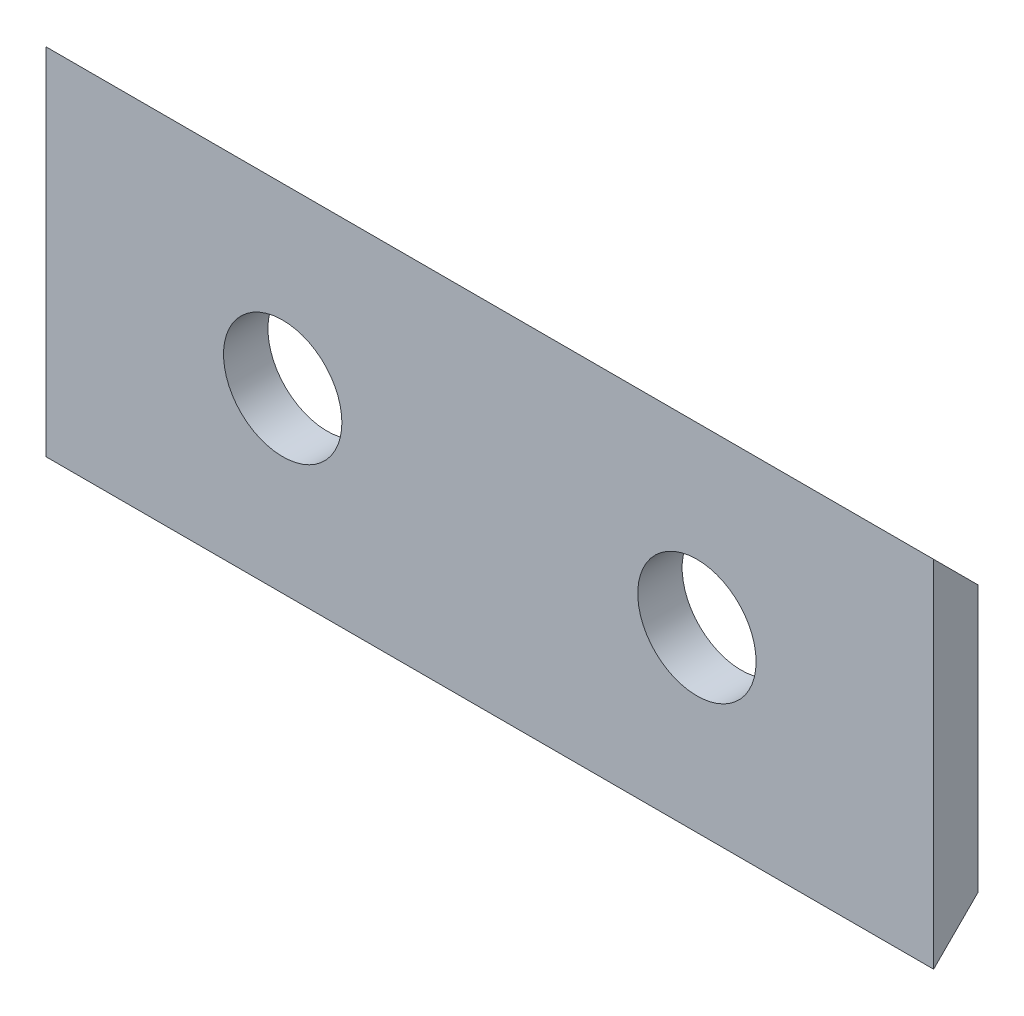
ISO-10303-21;
HEADER;
FILE_DESCRIPTION(('STEP AP214'),'2;1');
FILE_NAME('part.step','',(''),(''),'','','');
FILE_SCHEMA(('AUTOMOTIVE_DESIGN { 1 0 10303 214 1 1 1 1 }'));
ENDSEC;
DATA;
#1=APPLICATION_CONTEXT('core data for automotive mechanical design processes');
#2=APPLICATION_PROTOCOL_DEFINITION('international standard','automotive_design',2000,#1);
#3=PRODUCT_CONTEXT('',#1,'mechanical');
#4=PRODUCT('Part','Part','',(#3));
#5=PRODUCT_RELATED_PRODUCT_CATEGORY('part','',(#4));
#6=PRODUCT_DEFINITION_FORMATION('','',#4);
#7=PRODUCT_DEFINITION_CONTEXT('part definition',#1,'design');
#8=PRODUCT_DEFINITION('design','',#6,#7);
#9=PRODUCT_DEFINITION_SHAPE('','',#8);
#10=(LENGTH_UNIT() NAMED_UNIT(*) SI_UNIT(.MILLI.,.METRE.));
#11=(NAMED_UNIT(*) PLANE_ANGLE_UNIT() SI_UNIT($,.RADIAN.));
#12=(NAMED_UNIT(*) SI_UNIT($,.STERADIAN.) SOLID_ANGLE_UNIT());
#13=UNCERTAINTY_MEASURE_WITH_UNIT(LENGTH_MEASURE(1.E-05),#10,'distance_accuracy_value','');
#14=(GEOMETRIC_REPRESENTATION_CONTEXT(3) GLOBAL_UNCERTAINTY_ASSIGNED_CONTEXT((#13)) GLOBAL_UNIT_ASSIGNED_CONTEXT((#10,
#11,#12)) REPRESENTATION_CONTEXT('',''));
#15=CARTESIAN_POINT('',(0.,0.,0.));
#16=DIRECTION('',(0.,0.,1.));
#17=DIRECTION('',(1.,0.,0.));
#18=AXIS2_PLACEMENT_3D('',#15,#16,#17);
#19=CARTESIAN_POINT('',(0.,0.,1.5));
#20=DIRECTION('',(0.,0.,1.));
#21=DIRECTION('',(1.,0.,0.));
#22=AXIS2_PLACEMENT_3D('',#19,#20,#21);
#23=PLANE('',#22);
#24=CARTESIAN_POINT('',(-22.,6.,1.5));
#25=DIRECTION('',(0.,0.,1.));
#26=DIRECTION('',(1.,0.,0.));
#27=AXIS2_PLACEMENT_3D('',#24,#25,#26);
#28=CIRCLE('',#27,2.);
#29=CARTESIAN_POINT('',(-20.,6.,1.5));
#30=VERTEX_POINT('',#29);
#31=EDGE_CURVE('E96',#30,#30,#28,.T.);
#32=ORIENTED_EDGE('',*,*,#31,.F.);
#33=EDGE_LOOP('',(#32));
#34=FACE_BOUND('',#33,.T.);
#35=DIRECTION('',(0.,1.,0.));
#36=VECTOR('',#35,1.);
#37=CARTESIAN_POINT('',(0.,0.,1.5));
#38=LINE('',#37,#36);
#39=CARTESIAN_POINT('',(0.,0.,1.5));
#40=VERTEX_POINT('',#39);
#41=CARTESIAN_POINT('',(0.,12.,1.5));
#42=VERTEX_POINT('',#41);
#43=EDGE_CURVE('E92',#40,#42,#38,.T.);
#44=ORIENTED_EDGE('',*,*,#43,.T.);
#45=DIRECTION('',(-1.,0.,0.));
#46=VECTOR('',#45,1.);
#47=CARTESIAN_POINT('',(0.,12.,1.5));
#48=LINE('',#47,#46);
#49=CARTESIAN_POINT('',(-30.,12.,1.5));
#50=VERTEX_POINT('',#49);
#51=EDGE_CURVE('E94',#42,#50,#48,.T.);
#52=ORIENTED_EDGE('',*,*,#51,.T.);
#53=DIRECTION('',(0.,-1.,0.));
#54=VECTOR('',#53,1.);
#55=CARTESIAN_POINT('',(-30.,0.,1.5));
#56=LINE('',#55,#54);
#57=CARTESIAN_POINT('',(-30.,0.,1.5));
#58=VERTEX_POINT('',#57);
#59=EDGE_CURVE('E41',#50,#58,#56,.T.);
#60=ORIENTED_EDGE('',*,*,#59,.T.);
#61=DIRECTION('',(1.,0.,0.));
#62=VECTOR('',#61,1.);
#63=CARTESIAN_POINT('',(0.,0.,1.5));
#64=LINE('',#63,#62);
#65=EDGE_CURVE('E11',#58,#40,#64,.T.);
#66=ORIENTED_EDGE('',*,*,#65,.T.);
#67=EDGE_LOOP('',(#44,#52,#60,#66));
#68=FACE_BOUND('',#67,.T.);
#69=CARTESIAN_POINT('',(-8.,6.,1.5));
#70=DIRECTION('',(0.,0.,1.));
#71=DIRECTION('',(1.,0.,0.));
#72=AXIS2_PLACEMENT_3D('',#69,#70,#71);
#73=CIRCLE('',#72,2.);
#74=CARTESIAN_POINT('',(-6.,6.,1.5));
#75=VERTEX_POINT('',#74);
#76=EDGE_CURVE('E107',#75,#75,#73,.T.);
#77=ORIENTED_EDGE('',*,*,#76,.F.);
#78=EDGE_LOOP('',(#77));
#79=FACE_BOUND('',#78,.T.);
#80=ADVANCED_FACE('F32',(#34,#68,#79),#23,.T.);
#81=CARTESIAN_POINT('',(0.,0.,0.));
#82=DIRECTION('',(0.,0.,1.));
#83=DIRECTION('',(1.,0.,0.));
#84=AXIS2_PLACEMENT_3D('',#81,#82,#83);
#85=PLANE('',#84);
#86=CARTESIAN_POINT('',(-22.,6.,0.));
#87=DIRECTION('',(0.,0.,1.));
#88=DIRECTION('',(1.,0.,0.));
#89=AXIS2_PLACEMENT_3D('',#86,#87,#88);
#90=CIRCLE('',#89,2.);
#91=CARTESIAN_POINT('',(-20.,6.,0.));
#92=VERTEX_POINT('',#91);
#93=EDGE_CURVE('E100',#92,#92,#90,.T.);
#94=ORIENTED_EDGE('',*,*,#93,.T.);
#95=EDGE_LOOP('',(#94));
#96=FACE_BOUND('',#95,.T.);
#97=DIRECTION('',(0.,1.,0.));
#98=VECTOR('',#97,1.);
#99=CARTESIAN_POINT('',(0.,0.,0.));
#100=LINE('',#99,#98);
#101=CARTESIAN_POINT('',(0.,1.49999999999998,0.));
#102=VERTEX_POINT('',#101);
#103=CARTESIAN_POINT('',(0.,10.5,0.));
#104=VERTEX_POINT('',#103);
#105=EDGE_CURVE('E87',#102,#104,#100,.T.);
#106=ORIENTED_EDGE('',*,*,#105,.F.);
#107=DIRECTION('',(1.,0.,0.));
#108=VECTOR('',#107,1.);
#109=CARTESIAN_POINT('',(-30.,1.49999999999998,0.));
#110=LINE('',#109,#108);
#111=CARTESIAN_POINT('',(-30.,1.49999999999998,0.));
#112=VERTEX_POINT('',#111);
#113=EDGE_CURVE('E76',#112,#102,#110,.T.);
#114=ORIENTED_EDGE('',*,*,#113,.F.);
#115=DIRECTION('',(0.,-1.,0.));
#116=VECTOR('',#115,1.);
#117=CARTESIAN_POINT('',(-30.,0.,0.));
#118=LINE('',#117,#116);
#119=CARTESIAN_POINT('',(-30.,10.5,0.));
#120=VERTEX_POINT('',#119);
#121=EDGE_CURVE('E36',#120,#112,#118,.T.);
#122=ORIENTED_EDGE('',*,*,#121,.F.);
#123=DIRECTION('',(1.,0.,0.));
#124=VECTOR('',#123,1.);
#125=CARTESIAN_POINT('',(-30.,10.5,0.));
#126=LINE('',#125,#124);
#127=EDGE_CURVE('E49',#120,#104,#126,.T.);
#128=ORIENTED_EDGE('',*,*,#127,.T.);
#129=EDGE_LOOP('',(#106,#114,#122,#128));
#130=FACE_BOUND('',#129,.T.);
#131=CARTESIAN_POINT('',(-8.,6.,0.));
#132=DIRECTION('',(0.,0.,1.));
#133=DIRECTION('',(1.,0.,0.));
#134=AXIS2_PLACEMENT_3D('',#131,#132,#133);
#135=CIRCLE('',#134,2.);
#136=CARTESIAN_POINT('',(-6.,6.,0.));
#137=VERTEX_POINT('',#136);
#138=EDGE_CURVE('E109',#137,#137,#135,.T.);
#139=ORIENTED_EDGE('',*,*,#138,.T.);
#140=EDGE_LOOP('',(#139));
#141=FACE_BOUND('',#140,.T.);
#142=ADVANCED_FACE('F85',(#96,#130,#141),#85,.F.);
#143=CARTESIAN_POINT('',(0.,0.,1.5));
#144=DIRECTION('',(-1.,0.,0.));
#145=DIRECTION('',(0.,0.,1.));
#146=AXIS2_PLACEMENT_3D('',#143,#144,#145);
#147=PLANE('',#146);
#148=ORIENTED_EDGE('',*,*,#43,.F.);
#149=DIRECTION('',(0.,-0.707106781186544,0.707106781186551));
#150=VECTOR('',#149,1.);
#151=CARTESIAN_POINT('',(0.,1.49999999999998,0.));
#152=LINE('',#151,#150);
#153=EDGE_CURVE('E57',#102,#40,#152,.T.);
#154=ORIENTED_EDGE('',*,*,#153,.F.);
#155=ORIENTED_EDGE('',*,*,#105,.T.);
#156=DIRECTION('',(0.,-0.707106781186544,-0.707106781186551));
#157=VECTOR('',#156,1.);
#158=CARTESIAN_POINT('',(0.,12.,1.5));
#159=LINE('',#158,#157);
#160=EDGE_CURVE('E88',#42,#104,#159,.T.);
#161=ORIENTED_EDGE('',*,*,#160,.F.);
#162=EDGE_LOOP('',(#148,#154,#155,#161));
#163=FACE_BOUND('',#162,.T.);
#164=ADVANCED_FACE('F34',(#163),#147,.F.);
#165=CARTESIAN_POINT('',(-30.,0.,1.5));
#166=DIRECTION('',(1.,0.,0.));
#167=DIRECTION('',(0.,0.,-1.));
#168=AXIS2_PLACEMENT_3D('',#165,#166,#167);
#169=PLANE('',#168);
#170=ORIENTED_EDGE('',*,*,#121,.T.);
#171=DIRECTION('',(0.,-0.707106781186544,0.707106781186551));
#172=VECTOR('',#171,1.);
#173=CARTESIAN_POINT('',(-30.,1.49999999999998,0.));
#174=LINE('',#173,#172);
#175=EDGE_CURVE('E73',#112,#58,#174,.T.);
#176=ORIENTED_EDGE('',*,*,#175,.T.);
#177=ORIENTED_EDGE('',*,*,#59,.F.);
#178=DIRECTION('',(0.,-0.707106781186544,-0.707106781186551));
#179=VECTOR('',#178,1.);
#180=CARTESIAN_POINT('',(-30.,12.,1.5));
#181=LINE('',#180,#179);
#182=EDGE_CURVE('E91',#50,#120,#181,.T.);
#183=ORIENTED_EDGE('',*,*,#182,.T.);
#184=EDGE_LOOP('',(#170,#176,#177,#183));
#185=FACE_BOUND('',#184,.T.);
#186=ADVANCED_FACE('F90',(#185),#169,.F.);
#187=CARTESIAN_POINT('',(-22.,6.,1.5));
#188=DIRECTION('',(0.,0.,-1.));
#189=DIRECTION('',(-1.,0.,0.));
#190=AXIS2_PLACEMENT_3D('',#187,#188,#189);
#191=CYLINDRICAL_SURFACE('',#190,2.);
#192=ORIENTED_EDGE('',*,*,#31,.T.);
#193=EDGE_LOOP('',(#192));
#194=FACE_BOUND('',#193,.T.);
#195=ORIENTED_EDGE('',*,*,#93,.F.);
#196=EDGE_LOOP('',(#195));
#197=FACE_BOUND('',#196,.T.);
#198=ADVANCED_FACE('F129',(#194,#197),#191,.F.);
#199=CARTESIAN_POINT('',(-8.,6.,1.5));
#200=DIRECTION('',(0.,0.,-1.));
#201=DIRECTION('',(-1.,0.,0.));
#202=AXIS2_PLACEMENT_3D('',#199,#200,#201);
#203=CYLINDRICAL_SURFACE('',#202,2.);
#204=ORIENTED_EDGE('',*,*,#76,.T.);
#205=EDGE_LOOP('',(#204));
#206=FACE_BOUND('',#205,.T.);
#207=ORIENTED_EDGE('',*,*,#138,.F.);
#208=EDGE_LOOP('',(#207));
#209=FACE_BOUND('',#208,.T.);
#210=ADVANCED_FACE('F126',(#206,#209),#203,.F.);
#211=CARTESIAN_POINT('',(-30.,12.,1.5));
#212=DIRECTION('',(0.,-0.707106781186551,0.707106781186544));
#213=DIRECTION('',(0.,-0.707106781186544,-0.707106781186551));
#214=AXIS2_PLACEMENT_3D('',#211,#212,#213);
#215=PLANE('',#214);
#216=ORIENTED_EDGE('',*,*,#160,.T.);
#217=ORIENTED_EDGE('',*,*,#127,.F.);
#218=ORIENTED_EDGE('',*,*,#182,.F.);
#219=ORIENTED_EDGE('',*,*,#51,.F.);
#220=EDGE_LOOP('',(#216,#217,#218,#219));
#221=FACE_BOUND('',#220,.T.);
#222=ADVANCED_FACE('F117',(#221),#215,.F.);
#223=CARTESIAN_POINT('',(-30.,1.49999999999998,0.));
#224=DIRECTION('',(0.,0.707106781186551,0.707106781186544));
#225=DIRECTION('',(0.,-0.707106781186544,0.707106781186551));
#226=AXIS2_PLACEMENT_3D('',#223,#224,#225);
#227=PLANE('',#226);
#228=ORIENTED_EDGE('',*,*,#153,.T.);
#229=ORIENTED_EDGE('',*,*,#65,.F.);
#230=ORIENTED_EDGE('',*,*,#175,.F.);
#231=ORIENTED_EDGE('',*,*,#113,.T.);
#232=EDGE_LOOP('',(#228,#229,#230,#231));
#233=FACE_BOUND('',#232,.T.);
#234=ADVANCED_FACE('F75',(#233),#227,.F.);
#235=CLOSED_SHELL('',(#80,#142,#164,#186,#198,#210,#222,#234));
#236=MANIFOLD_SOLID_BREP('B2',#235);
#237=ADVANCED_BREP_SHAPE_REPRESENTATION('',(#18,#236),#14);
#238=SHAPE_DEFINITION_REPRESENTATION(#9,#237);
ENDSEC;
END-ISO-10303-21;
